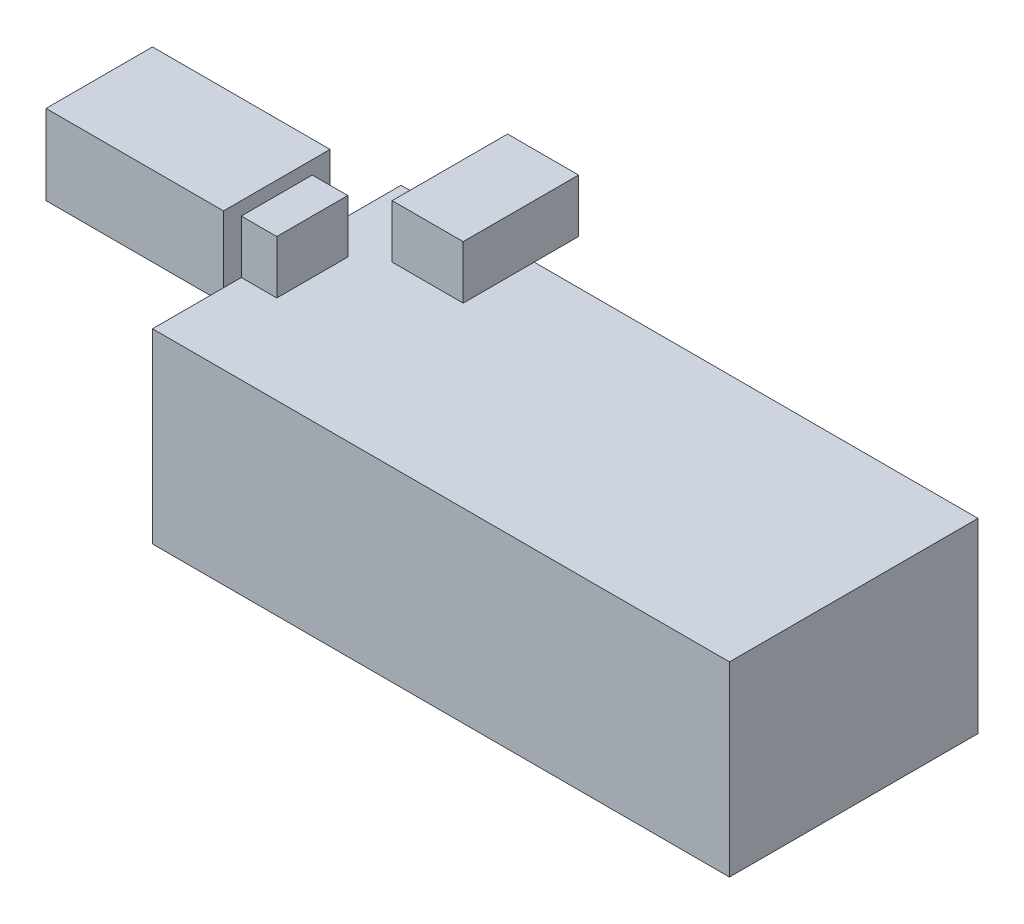
ISO-10303-21;
HEADER;
FILE_DESCRIPTION(('STEP AP214'),'2;1');
FILE_NAME('part.step','',(''),(''),'','','');
FILE_SCHEMA(('AUTOMOTIVE_DESIGN { 1 0 10303 214 1 1 1 1 }'));
ENDSEC;
DATA;
#1=APPLICATION_CONTEXT('core data for automotive mechanical design processes');
#2=APPLICATION_PROTOCOL_DEFINITION('international standard','automotive_design',2000,#1);
#3=PRODUCT_CONTEXT('',#1,'mechanical');
#4=PRODUCT('Part','Part','',(#3));
#5=PRODUCT_RELATED_PRODUCT_CATEGORY('part','',(#4));
#6=PRODUCT_DEFINITION_FORMATION('','',#4);
#7=PRODUCT_DEFINITION_CONTEXT('part definition',#1,'design');
#8=PRODUCT_DEFINITION('design','',#6,#7);
#9=PRODUCT_DEFINITION_SHAPE('','',#8);
#10=(LENGTH_UNIT() NAMED_UNIT(*) SI_UNIT(.MILLI.,.METRE.));
#11=(NAMED_UNIT(*) PLANE_ANGLE_UNIT() SI_UNIT($,.RADIAN.));
#12=(NAMED_UNIT(*) SI_UNIT($,.STERADIAN.) SOLID_ANGLE_UNIT());
#13=UNCERTAINTY_MEASURE_WITH_UNIT(LENGTH_MEASURE(1.E-05),#10,'distance_accuracy_value','');
#14=(GEOMETRIC_REPRESENTATION_CONTEXT(3) GLOBAL_UNCERTAINTY_ASSIGNED_CONTEXT((#13)) GLOBAL_UNIT_ASSIGNED_CONTEXT((#10,
#11,#12)) REPRESENTATION_CONTEXT('',''));
#15=CARTESIAN_POINT('',(0.,0.,0.));
#16=DIRECTION('',(0.,0.,1.));
#17=DIRECTION('',(1.,0.,0.));
#18=AXIS2_PLACEMENT_3D('',#15,#16,#17);
#19=CARTESIAN_POINT('',(-32.5,-21.,14.));
#20=DIRECTION('',(-1.,0.,0.));
#21=DIRECTION('',(0.,0.,1.));
#22=AXIS2_PLACEMENT_3D('',#19,#20,#21);
#23=PLANE('',#22);
#24=DIRECTION('',(0.,0.,1.));
#25=VECTOR('',#24,1.);
#26=CARTESIAN_POINT('',(-32.5,-1.5,0.));
#27=LINE('',#26,#25);
#28=CARTESIAN_POINT('',(-32.5,-1.5,-6.));
#29=VERTEX_POINT('',#28);
#30=CARTESIAN_POINT('',(-32.5,-1.5,6.));
#31=VERTEX_POINT('',#30);
#32=EDGE_CURVE('E58',#29,#31,#27,.T.);
#33=ORIENTED_EDGE('',*,*,#32,.F.);
#34=DIRECTION('',(0.,1.,0.));
#35=VECTOR('',#34,1.);
#36=CARTESIAN_POINT('',(-32.5,0.,-6.));
#37=LINE('',#36,#35);
#38=CARTESIAN_POINT('',(-32.5,0.,-6.));
#39=VERTEX_POINT('',#38);
#40=EDGE_CURVE('E201',#29,#39,#37,.T.);
#41=ORIENTED_EDGE('',*,*,#40,.T.);
#42=DIRECTION('',(0.,0.,1.));
#43=VECTOR('',#42,1.);
#44=CARTESIAN_POINT('',(-32.5,0.,14.));
#45=LINE('',#44,#43);
#46=CARTESIAN_POINT('',(-32.5,0.,-14.));
#47=VERTEX_POINT('',#46);
#48=EDGE_CURVE('E332',#47,#39,#45,.T.);
#49=ORIENTED_EDGE('',*,*,#48,.F.);
#50=DIRECTION('',(0.,1.,0.));
#51=VECTOR('',#50,1.);
#52=CARTESIAN_POINT('',(-32.5,-21.,-14.));
#53=LINE('',#52,#51);
#54=CARTESIAN_POINT('',(-32.5,-21.,-14.));
#55=VERTEX_POINT('',#54);
#56=EDGE_CURVE('E11',#55,#47,#53,.T.);
#57=ORIENTED_EDGE('',*,*,#56,.F.);
#58=DIRECTION('',(0.,0.,1.));
#59=VECTOR('',#58,1.);
#60=CARTESIAN_POINT('',(-32.5,-21.,14.));
#61=LINE('',#60,#59);
#62=CARTESIAN_POINT('',(-32.5,-21.,14.));
#63=VERTEX_POINT('',#62);
#64=EDGE_CURVE('E315',#55,#63,#61,.T.);
#65=ORIENTED_EDGE('',*,*,#64,.T.);
#66=DIRECTION('',(0.,1.,0.));
#67=VECTOR('',#66,1.);
#68=CARTESIAN_POINT('',(-32.5,-21.,14.));
#69=LINE('',#68,#67);
#70=CARTESIAN_POINT('',(-32.5,0.,14.));
#71=VERTEX_POINT('',#70);
#72=EDGE_CURVE('E44',#63,#71,#69,.T.);
#73=ORIENTED_EDGE('',*,*,#72,.T.);
#74=CARTESIAN_POINT('',(-32.5,0.,6.));
#75=VERTEX_POINT('',#74);
#76=EDGE_CURVE('E64',#75,#71,#45,.T.);
#77=ORIENTED_EDGE('',*,*,#76,.F.);
#78=DIRECTION('',(0.,1.,0.));
#79=VECTOR('',#78,1.);
#80=CARTESIAN_POINT('',(-32.5,0.,6.));
#81=LINE('',#80,#79);
#82=EDGE_CURVE('E226',#31,#75,#81,.T.);
#83=ORIENTED_EDGE('',*,*,#82,.F.);
#84=EDGE_LOOP('',(#33,#41,#49,#57,#65,#73,#77,#83));
#85=FACE_BOUND('',#84,.T.);
#86=ADVANCED_FACE('F41',(#85),#23,.T.);
#87=CARTESIAN_POINT('',(0.,0.,0.));
#88=DIRECTION('',(0.,1.,0.));
#89=DIRECTION('',(0.,0.,1.));
#90=AXIS2_PLACEMENT_3D('',#87,#88,#89);
#91=PLANE('',#90);
#92=DIRECTION('',(1.,0.,0.));
#93=VECTOR('',#92,1.);
#94=CARTESIAN_POINT('',(-25.5,0.,-6.));
#95=LINE('',#94,#93);
#96=CARTESIAN_POINT('',(-25.5,0.,-6.));
#97=VERTEX_POINT('',#96);
#98=CARTESIAN_POINT('',(-17.5,0.,-6.));
#99=VERTEX_POINT('',#98);
#100=EDGE_CURVE('E260',#97,#99,#95,.T.);
#101=ORIENTED_EDGE('',*,*,#100,.F.);
#102=DIRECTION('',(0.,0.,1.));
#103=VECTOR('',#102,1.);
#104=CARTESIAN_POINT('',(-25.5,0.,-14.));
#105=LINE('',#104,#103);
#106=CARTESIAN_POINT('',(-25.5,0.,-14.));
#107=VERTEX_POINT('',#106);
#108=EDGE_CURVE('E251',#107,#97,#105,.T.);
#109=ORIENTED_EDGE('',*,*,#108,.F.);
#110=DIRECTION('',(-1.,0.,0.));
#111=VECTOR('',#110,1.);
#112=CARTESIAN_POINT('',(32.5,0.,-14.));
#113=LINE('',#112,#111);
#114=EDGE_CURVE('E346',#107,#47,#113,.T.);
#115=ORIENTED_EDGE('',*,*,#114,.T.);
#116=ORIENTED_EDGE('',*,*,#48,.T.);
#117=CARTESIAN_POINT('',(-32.5,0.,-4.00000000000001));
#118=VERTEX_POINT('',#117);
#119=EDGE_CURVE('E337',#39,#118,#45,.T.);
#120=ORIENTED_EDGE('',*,*,#119,.T.);
#121=DIRECTION('',(1.,0.,0.));
#122=VECTOR('',#121,1.);
#123=CARTESIAN_POINT('',(-32.5,0.,-4.));
#124=LINE('',#123,#122);
#125=CARTESIAN_POINT('',(-28.5,0.,-4.));
#126=VERTEX_POINT('',#125);
#127=EDGE_CURVE('E279',#118,#126,#124,.T.);
#128=ORIENTED_EDGE('',*,*,#127,.T.);
#129=DIRECTION('',(0.,0.,-1.));
#130=VECTOR('',#129,1.);
#131=CARTESIAN_POINT('',(-28.5,0.,3.99999999999999));
#132=LINE('',#131,#130);
#133=CARTESIAN_POINT('',(-28.5,0.,3.99999999999999));
#134=VERTEX_POINT('',#133);
#135=EDGE_CURVE('E294',#134,#126,#132,.T.);
#136=ORIENTED_EDGE('',*,*,#135,.F.);
#137=DIRECTION('',(1.,0.,0.));
#138=VECTOR('',#137,1.);
#139=CARTESIAN_POINT('',(-32.5,0.,3.99999999999999));
#140=LINE('',#139,#138);
#141=CARTESIAN_POINT('',(-32.5,0.,3.99999999999999));
#142=VERTEX_POINT('',#141);
#143=EDGE_CURVE('E271',#142,#134,#140,.T.);
#144=ORIENTED_EDGE('',*,*,#143,.F.);
#145=EDGE_CURVE('E338',#142,#75,#45,.T.);
#146=ORIENTED_EDGE('',*,*,#145,.T.);
#147=ORIENTED_EDGE('',*,*,#76,.T.);
#148=DIRECTION('',(1.,0.,0.));
#149=VECTOR('',#148,1.);
#150=CARTESIAN_POINT('',(32.5,0.,14.));
#151=LINE('',#150,#149);
#152=CARTESIAN_POINT('',(32.5,0.,14.));
#153=VERTEX_POINT('',#152);
#154=EDGE_CURVE('E336',#71,#153,#151,.T.);
#155=ORIENTED_EDGE('',*,*,#154,.T.);
#156=DIRECTION('',(0.,0.,-1.));
#157=VECTOR('',#156,1.);
#158=CARTESIAN_POINT('',(32.5,0.,14.));
#159=LINE('',#158,#157);
#160=CARTESIAN_POINT('',(32.5,0.,-14.));
#161=VERTEX_POINT('',#160);
#162=EDGE_CURVE('E342',#153,#161,#159,.T.);
#163=ORIENTED_EDGE('',*,*,#162,.T.);
#164=CARTESIAN_POINT('',(-17.5,0.,-14.));
#165=VERTEX_POINT('',#164);
#166=EDGE_CURVE('E320',#161,#165,#113,.T.);
#167=ORIENTED_EDGE('',*,*,#166,.T.);
#168=DIRECTION('',(0.,0.,1.));
#169=VECTOR('',#168,1.);
#170=CARTESIAN_POINT('',(-17.5,0.,-14.));
#171=LINE('',#170,#169);
#172=EDGE_CURVE('E195',#165,#99,#171,.T.);
#173=ORIENTED_EDGE('',*,*,#172,.T.);
#174=EDGE_LOOP('',(#101,#109,#115,#116,#120,#128,#136,#144,#146,#147,#155,#163,#167,#173));
#175=FACE_BOUND('',#174,.T.);
#176=ADVANCED_FACE('F361',(#175),#91,.T.);
#177=CARTESIAN_POINT('',(32.5,-21.,-14.));
#178=DIRECTION('',(0.,0.,-1.));
#179=DIRECTION('',(-1.,0.,0.));
#180=AXIS2_PLACEMENT_3D('',#177,#178,#179);
#181=PLANE('',#180);
#182=DIRECTION('',(-1.,0.,0.));
#183=VECTOR('',#182,1.);
#184=CARTESIAN_POINT('',(-17.5,0.,-14.));
#185=LINE('',#184,#183);
#186=EDGE_CURVE('E190',#165,#107,#185,.T.);
#187=ORIENTED_EDGE('',*,*,#186,.F.);
#188=ORIENTED_EDGE('',*,*,#166,.F.);
#189=DIRECTION('',(0.,1.,0.));
#190=VECTOR('',#189,1.);
#191=CARTESIAN_POINT('',(32.5,-21.,-14.));
#192=LINE('',#191,#190);
#193=CARTESIAN_POINT('',(32.5,-21.,-14.));
#194=VERTEX_POINT('',#193);
#195=EDGE_CURVE('E50',#194,#161,#192,.T.);
#196=ORIENTED_EDGE('',*,*,#195,.F.);
#197=DIRECTION('',(-1.,0.,0.));
#198=VECTOR('',#197,1.);
#199=CARTESIAN_POINT('',(32.5,-21.,-14.));
#200=LINE('',#199,#198);
#201=EDGE_CURVE('E328',#194,#55,#200,.T.);
#202=ORIENTED_EDGE('',*,*,#201,.T.);
#203=ORIENTED_EDGE('',*,*,#56,.T.);
#204=ORIENTED_EDGE('',*,*,#114,.F.);
#205=EDGE_LOOP('',(#187,#188,#196,#202,#203,#204));
#206=FACE_BOUND('',#205,.T.);
#207=ADVANCED_FACE('F406',(#206),#181,.T.);
#208=CARTESIAN_POINT('',(32.5,-21.,14.));
#209=DIRECTION('',(1.,0.,0.));
#210=DIRECTION('',(0.,0.,-1.));
#211=AXIS2_PLACEMENT_3D('',#208,#209,#210);
#212=PLANE('',#211);
#213=ORIENTED_EDGE('',*,*,#162,.F.);
#214=DIRECTION('',(0.,1.,0.));
#215=VECTOR('',#214,1.);
#216=CARTESIAN_POINT('',(32.5,-21.,14.));
#217=LINE('',#216,#215);
#218=CARTESIAN_POINT('',(32.5,-21.,14.));
#219=VERTEX_POINT('',#218);
#220=EDGE_CURVE('E351',#219,#153,#217,.T.);
#221=ORIENTED_EDGE('',*,*,#220,.F.);
#222=DIRECTION('',(0.,0.,-1.));
#223=VECTOR('',#222,1.);
#224=CARTESIAN_POINT('',(32.5,-21.,14.));
#225=LINE('',#224,#223);
#226=EDGE_CURVE('E324',#219,#194,#225,.T.);
#227=ORIENTED_EDGE('',*,*,#226,.T.);
#228=ORIENTED_EDGE('',*,*,#195,.T.);
#229=EDGE_LOOP('',(#213,#221,#227,#228));
#230=FACE_BOUND('',#229,.T.);
#231=ADVANCED_FACE('F408',(#230),#212,.T.);
#232=CARTESIAN_POINT('',(32.5,-21.,14.));
#233=DIRECTION('',(0.,0.,1.));
#234=DIRECTION('',(1.,0.,0.));
#235=AXIS2_PLACEMENT_3D('',#232,#233,#234);
#236=PLANE('',#235);
#237=ORIENTED_EDGE('',*,*,#154,.F.);
#238=ORIENTED_EDGE('',*,*,#72,.F.);
#239=DIRECTION('',(1.,0.,0.));
#240=VECTOR('',#239,1.);
#241=CARTESIAN_POINT('',(32.5,-21.,14.));
#242=LINE('',#241,#240);
#243=EDGE_CURVE('E319',#63,#219,#242,.T.);
#244=ORIENTED_EDGE('',*,*,#243,.T.);
#245=ORIENTED_EDGE('',*,*,#220,.T.);
#246=EDGE_LOOP('',(#237,#238,#244,#245));
#247=FACE_BOUND('',#246,.T.);
#248=ADVANCED_FACE('F359',(#247),#236,.T.);
#249=CARTESIAN_POINT('',(0.,-21.,0.));
#250=DIRECTION('',(0.,1.,0.));
#251=DIRECTION('',(0.,0.,1.));
#252=AXIS2_PLACEMENT_3D('',#249,#250,#251);
#253=PLANE('',#252);
#254=ORIENTED_EDGE('',*,*,#64,.F.);
#255=ORIENTED_EDGE('',*,*,#201,.F.);
#256=ORIENTED_EDGE('',*,*,#226,.F.);
#257=ORIENTED_EDGE('',*,*,#243,.F.);
#258=EDGE_LOOP('',(#254,#255,#256,#257));
#259=FACE_BOUND('',#258,.T.);
#260=ADVANCED_FACE('F404',(#259),#253,.F.);
#261=CARTESIAN_POINT('',(-32.5,6.,3.99999999999999));
#262=DIRECTION('',(0.,0.,-1.));
#263=DIRECTION('',(-1.,0.,0.));
#264=AXIS2_PLACEMENT_3D('',#261,#262,#263);
#265=PLANE('',#264);
#266=ORIENTED_EDGE('',*,*,#143,.T.);
#267=DIRECTION('',(0.,-1.,0.));
#268=VECTOR('',#267,1.);
#269=CARTESIAN_POINT('',(-28.5,6.,3.99999999999999));
#270=LINE('',#269,#268);
#271=CARTESIAN_POINT('',(-28.5,6.,3.99999999999999));
#272=VERTEX_POINT('',#271);
#273=EDGE_CURVE('E311',#272,#134,#270,.T.);
#274=ORIENTED_EDGE('',*,*,#273,.F.);
#275=DIRECTION('',(1.,0.,0.));
#276=VECTOR('',#275,1.);
#277=CARTESIAN_POINT('',(-32.5,6.,3.99999999999999));
#278=LINE('',#277,#276);
#279=CARTESIAN_POINT('',(-32.5,6.,3.99999999999999));
#280=VERTEX_POINT('',#279);
#281=EDGE_CURVE('E274',#280,#272,#278,.T.);
#282=ORIENTED_EDGE('',*,*,#281,.F.);
#283=DIRECTION('',(0.,-1.,0.));
#284=VECTOR('',#283,1.);
#285=CARTESIAN_POINT('',(-32.5,6.,3.99999999999999));
#286=LINE('',#285,#284);
#287=EDGE_CURVE('E290',#280,#142,#286,.T.);
#288=ORIENTED_EDGE('',*,*,#287,.T.);
#289=EDGE_LOOP('',(#266,#274,#282,#288));
#290=FACE_BOUND('',#289,.T.);
#291=ADVANCED_FACE('F386',(#290),#265,.F.);
#292=CARTESIAN_POINT('',(-28.5,6.,3.99999999999999));
#293=DIRECTION('',(-1.,0.,0.));
#294=DIRECTION('',(0.,0.,1.));
#295=AXIS2_PLACEMENT_3D('',#292,#293,#294);
#296=PLANE('',#295);
#297=ORIENTED_EDGE('',*,*,#135,.T.);
#298=DIRECTION('',(0.,-1.,0.));
#299=VECTOR('',#298,1.);
#300=CARTESIAN_POINT('',(-28.5,6.,-4.));
#301=LINE('',#300,#299);
#302=CARTESIAN_POINT('',(-28.5,6.,-4.));
#303=VERTEX_POINT('',#302);
#304=EDGE_CURVE('E307',#303,#126,#301,.T.);
#305=ORIENTED_EDGE('',*,*,#304,.F.);
#306=DIRECTION('',(0.,0.,-1.));
#307=VECTOR('',#306,1.);
#308=CARTESIAN_POINT('',(-28.5,6.,3.99999999999999));
#309=LINE('',#308,#307);
#310=EDGE_CURVE('E278',#272,#303,#309,.T.);
#311=ORIENTED_EDGE('',*,*,#310,.F.);
#312=ORIENTED_EDGE('',*,*,#273,.T.);
#313=EDGE_LOOP('',(#297,#305,#311,#312));
#314=FACE_BOUND('',#313,.T.);
#315=ADVANCED_FACE('F384',(#314),#296,.F.);
#316=CARTESIAN_POINT('',(-32.5,6.,-4.));
#317=DIRECTION('',(0.,0.,-1.));
#318=DIRECTION('',(-1.,0.,0.));
#319=AXIS2_PLACEMENT_3D('',#316,#317,#318);
#320=PLANE('',#319);
#321=ORIENTED_EDGE('',*,*,#127,.F.);
#322=DIRECTION('',(0.,-1.,0.));
#323=VECTOR('',#322,1.);
#324=CARTESIAN_POINT('',(-32.5,6.,-4.));
#325=LINE('',#324,#323);
#326=CARTESIAN_POINT('',(-32.5,6.,-4.));
#327=VERTEX_POINT('',#326);
#328=EDGE_CURVE('E303',#327,#118,#325,.T.);
#329=ORIENTED_EDGE('',*,*,#328,.F.);
#330=DIRECTION('',(1.,0.,0.));
#331=VECTOR('',#330,1.);
#332=CARTESIAN_POINT('',(-32.5,6.,-4.));
#333=LINE('',#332,#331);
#334=EDGE_CURVE('E282',#327,#303,#333,.T.);
#335=ORIENTED_EDGE('',*,*,#334,.T.);
#336=ORIENTED_EDGE('',*,*,#304,.T.);
#337=EDGE_LOOP('',(#321,#329,#335,#336));
#338=FACE_BOUND('',#337,.T.);
#339=ADVANCED_FACE('F374',(#338),#320,.T.);
#340=CARTESIAN_POINT('',(0.,6.,0.));
#341=DIRECTION('',(0.,1.,0.));
#342=DIRECTION('',(0.,0.,1.));
#343=AXIS2_PLACEMENT_3D('',#340,#341,#342);
#344=PLANE('',#343);
#345=ORIENTED_EDGE('',*,*,#281,.T.);
#346=ORIENTED_EDGE('',*,*,#310,.T.);
#347=ORIENTED_EDGE('',*,*,#334,.F.);
#348=DIRECTION('',(0.,0.,-1.));
#349=VECTOR('',#348,1.);
#350=CARTESIAN_POINT('',(-32.5,6.,3.99999999999999));
#351=LINE('',#350,#349);
#352=EDGE_CURVE('E286',#280,#327,#351,.T.);
#353=ORIENTED_EDGE('',*,*,#352,.F.);
#354=EDGE_LOOP('',(#345,#346,#347,#353));
#355=FACE_BOUND('',#354,.T.);
#356=ADVANCED_FACE('F381',(#355),#344,.T.);
#357=CARTESIAN_POINT('',(-25.5,6.,-14.));
#358=DIRECTION('',(1.,0.,0.));
#359=DIRECTION('',(0.,0.,-1.));
#360=AXIS2_PLACEMENT_3D('',#357,#358,#359);
#361=PLANE('',#360);
#362=ORIENTED_EDGE('',*,*,#108,.T.);
#363=DIRECTION('',(0.,-1.,0.));
#364=VECTOR('',#363,1.);
#365=CARTESIAN_POINT('',(-25.5,6.,-6.));
#366=LINE('',#365,#364);
#367=CARTESIAN_POINT('',(-25.5,6.,-6.));
#368=VERTEX_POINT('',#367);
#369=EDGE_CURVE('E267',#368,#97,#366,.T.);
#370=ORIENTED_EDGE('',*,*,#369,.F.);
#371=DIRECTION('',(0.,0.,1.));
#372=VECTOR('',#371,1.);
#373=CARTESIAN_POINT('',(-25.5,6.,-14.));
#374=LINE('',#373,#372);
#375=CARTESIAN_POINT('',(-25.5,6.,-19.));
#376=VERTEX_POINT('',#375);
#377=EDGE_CURVE('E254',#376,#368,#374,.T.);
#378=ORIENTED_EDGE('',*,*,#377,.F.);
#379=DIRECTION('',(0.,1.,0.));
#380=VECTOR('',#379,1.);
#381=CARTESIAN_POINT('',(-25.5,6.,-19.));
#382=LINE('',#381,#380);
#383=CARTESIAN_POINT('',(-25.5,0.,-19.));
#384=VERTEX_POINT('',#383);
#385=EDGE_CURVE('E179',#384,#376,#382,.T.);
#386=ORIENTED_EDGE('',*,*,#385,.F.);
#387=DIRECTION('',(0.,0.,1.));
#388=VECTOR('',#387,1.);
#389=CARTESIAN_POINT('',(-25.5,0.,-19.));
#390=LINE('',#389,#388);
#391=EDGE_CURVE('E174',#384,#107,#390,.T.);
#392=ORIENTED_EDGE('',*,*,#391,.T.);
#393=EDGE_LOOP('',(#362,#370,#378,#386,#392));
#394=FACE_BOUND('',#393,.T.);
#395=ADVANCED_FACE('F434',(#394),#361,.F.);
#396=CARTESIAN_POINT('',(-25.5,6.,-6.));
#397=DIRECTION('',(0.,0.,-1.));
#398=DIRECTION('',(-1.,0.,0.));
#399=AXIS2_PLACEMENT_3D('',#396,#397,#398);
#400=PLANE('',#399);
#401=ORIENTED_EDGE('',*,*,#100,.T.);
#402=DIRECTION('',(0.,-1.,0.));
#403=VECTOR('',#402,1.);
#404=CARTESIAN_POINT('',(-17.5,6.,-6.));
#405=LINE('',#404,#403);
#406=CARTESIAN_POINT('',(-17.5,6.,-6.));
#407=VERTEX_POINT('',#406);
#408=EDGE_CURVE('E257',#407,#99,#405,.T.);
#409=ORIENTED_EDGE('',*,*,#408,.F.);
#410=DIRECTION('',(1.,0.,0.));
#411=VECTOR('',#410,1.);
#412=CARTESIAN_POINT('',(-25.5,6.,-6.));
#413=LINE('',#412,#411);
#414=EDGE_CURVE('E250',#368,#407,#413,.T.);
#415=ORIENTED_EDGE('',*,*,#414,.F.);
#416=ORIENTED_EDGE('',*,*,#369,.T.);
#417=EDGE_LOOP('',(#401,#409,#415,#416));
#418=FACE_BOUND('',#417,.T.);
#419=ADVANCED_FACE('F438',(#418),#400,.F.);
#420=CARTESIAN_POINT('',(-17.5,6.,-14.));
#421=DIRECTION('',(1.,0.,0.));
#422=DIRECTION('',(0.,0.,-1.));
#423=AXIS2_PLACEMENT_3D('',#420,#421,#422);
#424=PLANE('',#423);
#425=ORIENTED_EDGE('',*,*,#172,.F.);
#426=DIRECTION('',(0.,0.,1.));
#427=VECTOR('',#426,1.);
#428=CARTESIAN_POINT('',(-17.5,0.,-19.));
#429=LINE('',#428,#427);
#430=CARTESIAN_POINT('',(-17.5,0.,-19.));
#431=VERTEX_POINT('',#430);
#432=EDGE_CURVE('E172',#431,#165,#429,.T.);
#433=ORIENTED_EDGE('',*,*,#432,.F.);
#434=DIRECTION('',(0.,-1.,0.));
#435=VECTOR('',#434,1.);
#436=CARTESIAN_POINT('',(-17.5,6.,-19.));
#437=LINE('',#436,#435);
#438=CARTESIAN_POINT('',(-17.5,6.,-19.));
#439=VERTEX_POINT('',#438);
#440=EDGE_CURVE('E180',#439,#431,#437,.T.);
#441=ORIENTED_EDGE('',*,*,#440,.F.);
#442=DIRECTION('',(0.,0.,1.));
#443=VECTOR('',#442,1.);
#444=CARTESIAN_POINT('',(-17.5,6.,-14.));
#445=LINE('',#444,#443);
#446=EDGE_CURVE('E247',#439,#407,#445,.T.);
#447=ORIENTED_EDGE('',*,*,#446,.T.);
#448=ORIENTED_EDGE('',*,*,#408,.T.);
#449=EDGE_LOOP('',(#425,#433,#441,#447,#448));
#450=FACE_BOUND('',#449,.T.);
#451=ADVANCED_FACE('F193',(#450),#424,.T.);
#452=CARTESIAN_POINT('',(0.,6.,0.));
#453=DIRECTION('',(0.,-1.,0.));
#454=DIRECTION('',(0.,0.,-1.));
#455=AXIS2_PLACEMENT_3D('',#452,#453,#454);
#456=PLANE('',#455);
#457=ORIENTED_EDGE('',*,*,#446,.F.);
#458=DIRECTION('',(1.,0.,0.));
#459=VECTOR('',#458,1.);
#460=CARTESIAN_POINT('',(-17.5,6.,-19.));
#461=LINE('',#460,#459);
#462=EDGE_CURVE('E186',#376,#439,#461,.T.);
#463=ORIENTED_EDGE('',*,*,#462,.F.);
#464=ORIENTED_EDGE('',*,*,#377,.T.);
#465=ORIENTED_EDGE('',*,*,#414,.T.);
#466=EDGE_LOOP('',(#457,#463,#464,#465));
#467=FACE_BOUND('',#466,.T.);
#468=ADVANCED_FACE('F437',(#467),#456,.F.);
#469=CARTESIAN_POINT('',(-52.5,0.,-6.));
#470=DIRECTION('',(0.,0.,-1.));
#471=DIRECTION('',(-1.,0.,0.));
#472=AXIS2_PLACEMENT_3D('',#469,#470,#471);
#473=PLANE('',#472);
#474=ORIENTED_EDGE('',*,*,#40,.F.);
#475=DIRECTION('',(1.,0.,0.));
#476=VECTOR('',#475,1.);
#477=CARTESIAN_POINT('',(-52.5,-1.5,-6.));
#478=LINE('',#477,#476);
#479=CARTESIAN_POINT('',(-52.5,-1.5,-6.));
#480=VERTEX_POINT('',#479);
#481=EDGE_CURVE('E244',#480,#29,#478,.T.);
#482=ORIENTED_EDGE('',*,*,#481,.F.);
#483=DIRECTION('',(0.,1.,0.));
#484=VECTOR('',#483,1.);
#485=CARTESIAN_POINT('',(-52.5,0.,-6.));
#486=LINE('',#485,#484);
#487=CARTESIAN_POINT('',(-52.5,7.5,-6.));
#488=VERTEX_POINT('',#487);
#489=EDGE_CURVE('E206',#480,#488,#486,.T.);
#490=ORIENTED_EDGE('',*,*,#489,.T.);
#491=DIRECTION('',(1.,0.,0.));
#492=VECTOR('',#491,1.);
#493=CARTESIAN_POINT('',(-52.5,7.5,-6.));
#494=LINE('',#493,#492);
#495=CARTESIAN_POINT('',(-32.5,7.5,-6.));
#496=VERTEX_POINT('',#495);
#497=EDGE_CURVE('E220',#488,#496,#494,.T.);
#498=ORIENTED_EDGE('',*,*,#497,.T.);
#499=EDGE_CURVE('E197',#39,#496,#37,.T.);
#500=ORIENTED_EDGE('',*,*,#499,.F.);
#501=EDGE_LOOP('',(#474,#482,#490,#498,#500));
#502=FACE_BOUND('',#501,.T.);
#503=ADVANCED_FACE('F400',(#502),#473,.T.);
#504=CARTESIAN_POINT('',(-52.5,-1.5,0.));
#505=DIRECTION('',(0.,1.,0.));
#506=DIRECTION('',(0.,0.,1.));
#507=AXIS2_PLACEMENT_3D('',#504,#505,#506);
#508=PLANE('',#507);
#509=ORIENTED_EDGE('',*,*,#32,.T.);
#510=DIRECTION('',(1.,0.,0.));
#511=VECTOR('',#510,1.);
#512=CARTESIAN_POINT('',(-52.5,-1.5,6.));
#513=LINE('',#512,#511);
#514=CARTESIAN_POINT('',(-52.5,-1.5,6.));
#515=VERTEX_POINT('',#514);
#516=EDGE_CURVE('E240',#515,#31,#513,.T.);
#517=ORIENTED_EDGE('',*,*,#516,.F.);
#518=DIRECTION('',(0.,0.,1.));
#519=VECTOR('',#518,1.);
#520=CARTESIAN_POINT('',(-52.5,-1.5,0.));
#521=LINE('',#520,#519);
#522=EDGE_CURVE('E210',#480,#515,#521,.T.);
#523=ORIENTED_EDGE('',*,*,#522,.F.);
#524=ORIENTED_EDGE('',*,*,#481,.T.);
#525=EDGE_LOOP('',(#509,#517,#523,#524));
#526=FACE_BOUND('',#525,.T.);
#527=ADVANCED_FACE('F395',(#526),#508,.F.);
#528=CARTESIAN_POINT('',(-52.5,0.,6.));
#529=DIRECTION('',(0.,0.,-1.));
#530=DIRECTION('',(-1.,0.,0.));
#531=AXIS2_PLACEMENT_3D('',#528,#529,#530);
#532=PLANE('',#531);
#533=ORIENTED_EDGE('',*,*,#82,.T.);
#534=CARTESIAN_POINT('',(-32.5,7.5,6.));
#535=VERTEX_POINT('',#534);
#536=EDGE_CURVE('E225',#75,#535,#81,.T.);
#537=ORIENTED_EDGE('',*,*,#536,.T.);
#538=DIRECTION('',(1.,0.,0.));
#539=VECTOR('',#538,1.);
#540=CARTESIAN_POINT('',(-52.5,7.5,6.));
#541=LINE('',#540,#539);
#542=CARTESIAN_POINT('',(-52.5,7.5,6.));
#543=VERTEX_POINT('',#542);
#544=EDGE_CURVE('E236',#543,#535,#541,.T.);
#545=ORIENTED_EDGE('',*,*,#544,.F.);
#546=DIRECTION('',(0.,1.,0.));
#547=VECTOR('',#546,1.);
#548=CARTESIAN_POINT('',(-52.5,0.,6.));
#549=LINE('',#548,#547);
#550=EDGE_CURVE('E214',#515,#543,#549,.T.);
#551=ORIENTED_EDGE('',*,*,#550,.F.);
#552=ORIENTED_EDGE('',*,*,#516,.T.);
#553=EDGE_LOOP('',(#533,#537,#545,#551,#552));
#554=FACE_BOUND('',#553,.T.);
#555=ADVANCED_FACE('F391',(#554),#532,.F.);
#556=CARTESIAN_POINT('',(-52.5,7.5,0.));
#557=DIRECTION('',(0.,1.,0.));
#558=DIRECTION('',(0.,0.,1.));
#559=AXIS2_PLACEMENT_3D('',#556,#557,#558);
#560=PLANE('',#559);
#561=DIRECTION('',(0.,0.,1.));
#562=VECTOR('',#561,1.);
#563=CARTESIAN_POINT('',(-32.5,7.5,0.));
#564=LINE('',#563,#562);
#565=EDGE_CURVE('E211',#496,#535,#564,.T.);
#566=ORIENTED_EDGE('',*,*,#565,.F.);
#567=ORIENTED_EDGE('',*,*,#497,.F.);
#568=DIRECTION('',(0.,0.,1.));
#569=VECTOR('',#568,1.);
#570=CARTESIAN_POINT('',(-52.5,7.5,0.));
#571=LINE('',#570,#569);
#572=EDGE_CURVE('E217',#488,#543,#571,.T.);
#573=ORIENTED_EDGE('',*,*,#572,.T.);
#574=ORIENTED_EDGE('',*,*,#544,.T.);
#575=EDGE_LOOP('',(#566,#567,#573,#574));
#576=FACE_BOUND('',#575,.T.);
#577=ADVANCED_FACE('F454',(#576),#560,.T.);
#578=CARTESIAN_POINT('',(-52.5,0.,0.));
#579=DIRECTION('',(-1.,0.,0.));
#580=DIRECTION('',(0.,0.,1.));
#581=AXIS2_PLACEMENT_3D('',#578,#579,#580);
#582=PLANE('',#581);
#583=ORIENTED_EDGE('',*,*,#489,.F.);
#584=ORIENTED_EDGE('',*,*,#522,.T.);
#585=ORIENTED_EDGE('',*,*,#550,.T.);
#586=ORIENTED_EDGE('',*,*,#572,.F.);
#587=EDGE_LOOP('',(#583,#584,#585,#586));
#588=FACE_BOUND('',#587,.T.);
#589=ADVANCED_FACE('F457',(#588),#582,.T.);
#590=CARTESIAN_POINT('',(-32.5,0.,0.));
#591=DIRECTION('',(-1.,0.,0.));
#592=DIRECTION('',(0.,0.,1.));
#593=AXIS2_PLACEMENT_3D('',#590,#591,#592);
#594=PLANE('',#593);
#595=ORIENTED_EDGE('',*,*,#119,.F.);
#596=ORIENTED_EDGE('',*,*,#499,.T.);
#597=ORIENTED_EDGE('',*,*,#565,.T.);
#598=ORIENTED_EDGE('',*,*,#536,.F.);
#599=ORIENTED_EDGE('',*,*,#145,.F.);
#600=ORIENTED_EDGE('',*,*,#287,.F.);
#601=ORIENTED_EDGE('',*,*,#352,.T.);
#602=ORIENTED_EDGE('',*,*,#328,.T.);
#603=EDGE_LOOP('',(#595,#596,#597,#598,#599,#600,#601,#602));
#604=FACE_BOUND('',#603,.T.);
#605=ADVANCED_FACE('F377',(#604),#594,.F.);
#606=CARTESIAN_POINT('',(-17.5,0.,-19.));
#607=DIRECTION('',(0.,1.,0.));
#608=DIRECTION('',(0.,0.,1.));
#609=AXIS2_PLACEMENT_3D('',#606,#607,#608);
#610=PLANE('',#609);
#611=ORIENTED_EDGE('',*,*,#186,.T.);
#612=ORIENTED_EDGE('',*,*,#391,.F.);
#613=DIRECTION('',(-1.,0.,0.));
#614=VECTOR('',#613,1.);
#615=CARTESIAN_POINT('',(-17.5,0.,-19.));
#616=LINE('',#615,#614);
#617=EDGE_CURVE('E167',#431,#384,#616,.T.);
#618=ORIENTED_EDGE('',*,*,#617,.F.);
#619=ORIENTED_EDGE('',*,*,#432,.T.);
#620=EDGE_LOOP('',(#611,#612,#618,#619));
#621=FACE_BOUND('',#620,.T.);
#622=ADVANCED_FACE('F170',(#621),#610,.F.);
#623=CARTESIAN_POINT('',(0.,0.,-19.));
#624=DIRECTION('',(0.,0.,-1.));
#625=DIRECTION('',(-1.,0.,0.));
#626=AXIS2_PLACEMENT_3D('',#623,#624,#625);
#627=PLANE('',#626);
#628=ORIENTED_EDGE('',*,*,#440,.T.);
#629=ORIENTED_EDGE('',*,*,#617,.T.);
#630=ORIENTED_EDGE('',*,*,#385,.T.);
#631=ORIENTED_EDGE('',*,*,#462,.T.);
#632=EDGE_LOOP('',(#628,#629,#630,#631));
#633=FACE_BOUND('',#632,.T.);
#634=ADVANCED_FACE('F184',(#633),#627,.T.);
#635=CLOSED_SHELL('',(#86,#176,#207,#231,#248,#260,#291,#315,#339,#356,#395,#419,#451,#468,#503,
#527,#555,#577,#589,#605,#622,#634));
#636=MANIFOLD_SOLID_BREP('B2',#635);
#637=ADVANCED_BREP_SHAPE_REPRESENTATION('',(#18,#636),#14);
#638=SHAPE_DEFINITION_REPRESENTATION(#9,#637);
ENDSEC;
END-ISO-10303-21;
